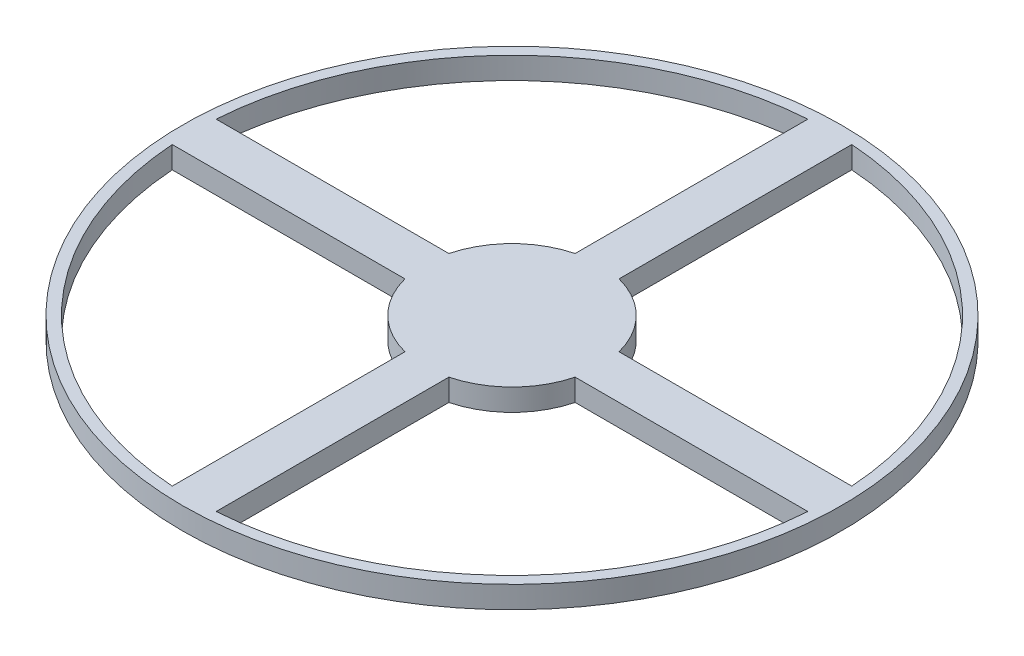
ISO-10303-21;
HEADER;
FILE_DESCRIPTION(('STEP AP214'),'2;1');
FILE_NAME('part.step','',(''),(''),'','','');
FILE_SCHEMA(('AUTOMOTIVE_DESIGN { 1 0 10303 214 1 1 1 1 }'));
ENDSEC;
DATA;
#1=APPLICATION_CONTEXT('core data for automotive mechanical design processes');
#2=APPLICATION_PROTOCOL_DEFINITION('international standard','automotive_design',2000,#1);
#3=PRODUCT_CONTEXT('',#1,'mechanical');
#4=PRODUCT('Part','Part','',(#3));
#5=PRODUCT_RELATED_PRODUCT_CATEGORY('part','',(#4));
#6=PRODUCT_DEFINITION_FORMATION('','',#4);
#7=PRODUCT_DEFINITION_CONTEXT('part definition',#1,'design');
#8=PRODUCT_DEFINITION('design','',#6,#7);
#9=PRODUCT_DEFINITION_SHAPE('','',#8);
#10=(LENGTH_UNIT() NAMED_UNIT(*) SI_UNIT(.MILLI.,.METRE.));
#11=(NAMED_UNIT(*) PLANE_ANGLE_UNIT() SI_UNIT($,.RADIAN.));
#12=(NAMED_UNIT(*) SI_UNIT($,.STERADIAN.) SOLID_ANGLE_UNIT());
#13=UNCERTAINTY_MEASURE_WITH_UNIT(LENGTH_MEASURE(1.E-05),#10,'distance_accuracy_value','');
#14=(GEOMETRIC_REPRESENTATION_CONTEXT(3) GLOBAL_UNCERTAINTY_ASSIGNED_CONTEXT((#13)) GLOBAL_UNIT_ASSIGNED_CONTEXT((#10,
#11,#12)) REPRESENTATION_CONTEXT('',''));
#15=CARTESIAN_POINT('',(0.,0.,0.));
#16=DIRECTION('',(0.,0.,1.));
#17=DIRECTION('',(1.,0.,0.));
#18=AXIS2_PLACEMENT_3D('',#15,#16,#17);
#19=CARTESIAN_POINT('',(0.,6.35,0.));
#20=DIRECTION('',(0.,-1.,0.));
#21=DIRECTION('',(0.,0.,-1.));
#22=AXIS2_PLACEMENT_3D('',#19,#20,#21);
#23=CYLINDRICAL_SURFACE('',#22,25.4);
#24=DIRECTION('',(0.,-1.,0.));
#25=VECTOR('',#24,1.);
#26=CARTESIAN_POINT('',(6.34999999999975,6.35,24.5934442484172));
#27=LINE('',#26,#25);
#28=CARTESIAN_POINT('',(6.34999999999975,6.35,24.5934442484172));
#29=VERTEX_POINT('',#28);
#30=CARTESIAN_POINT('',(6.34999999999975,0.,24.5934442484172));
#31=VERTEX_POINT('',#30);
#32=EDGE_CURVE('E159',#29,#31,#27,.T.);
#33=ORIENTED_EDGE('',*,*,#32,.T.);
#34=CARTESIAN_POINT('',(0.,0.,0.));
#35=DIRECTION('',(0.,1.,0.));
#36=DIRECTION('',(0.,0.,1.));
#37=AXIS2_PLACEMENT_3D('',#34,#35,#36);
#38=CIRCLE('',#37,25.4);
#39=CARTESIAN_POINT('',(24.5934442484171,0.,6.35));
#40=VERTEX_POINT('',#39);
#41=EDGE_CURVE('E205',#31,#40,#38,.T.);
#42=ORIENTED_EDGE('',*,*,#41,.T.);
#43=DIRECTION('',(0.,-1.,0.));
#44=VECTOR('',#43,1.);
#45=CARTESIAN_POINT('',(24.5934442484171,6.35,6.35));
#46=LINE('',#45,#44);
#47=CARTESIAN_POINT('',(24.5934442484171,6.35,6.35));
#48=VERTEX_POINT('',#47);
#49=EDGE_CURVE('E254',#48,#40,#46,.T.);
#50=ORIENTED_EDGE('',*,*,#49,.F.);
#51=CARTESIAN_POINT('',(0.,6.35,0.));
#52=DIRECTION('',(0.,1.,0.));
#53=DIRECTION('',(0.,0.,1.));
#54=AXIS2_PLACEMENT_3D('',#51,#52,#53);
#55=CIRCLE('',#54,25.4);
#56=EDGE_CURVE('E55',#29,#48,#55,.T.);
#57=ORIENTED_EDGE('',*,*,#56,.F.);
#58=EDGE_LOOP('',(#33,#42,#50,#57));
#59=FACE_BOUND('',#58,.T.);
#60=ADVANCED_FACE('F40',(#59),#23,.T.);
#61=DIRECTION('',(0.,-1.,0.));
#62=VECTOR('',#61,1.);
#63=CARTESIAN_POINT('',(-6.35000000000026,6.35,24.593444248417));
#64=LINE('',#63,#62);
#65=CARTESIAN_POINT('',(-6.35000000000026,6.35,24.593444248417));
#66=VERTEX_POINT('',#65);
#67=CARTESIAN_POINT('',(-6.35000000000026,0.,24.593444248417));
#68=VERTEX_POINT('',#67);
#69=EDGE_CURVE('E63',#66,#68,#64,.T.);
#70=ORIENTED_EDGE('',*,*,#69,.F.);
#71=CARTESIAN_POINT('',(-24.5934442484171,6.35,6.35000000000001));
#72=VERTEX_POINT('',#71);
#73=EDGE_CURVE('E199',#72,#66,#55,.T.);
#74=ORIENTED_EDGE('',*,*,#73,.F.);
#75=DIRECTION('',(0.,-1.,0.));
#76=VECTOR('',#75,1.);
#77=CARTESIAN_POINT('',(-24.5934442484171,6.35,6.35000000000001));
#78=LINE('',#77,#76);
#79=CARTESIAN_POINT('',(-24.5934442484171,0.,6.35000000000001));
#80=VERTEX_POINT('',#79);
#81=EDGE_CURVE('E48',#72,#80,#78,.T.);
#82=ORIENTED_EDGE('',*,*,#81,.T.);
#83=EDGE_CURVE('E203',#80,#68,#38,.T.);
#84=ORIENTED_EDGE('',*,*,#83,.T.);
#85=EDGE_LOOP('',(#70,#74,#82,#84));
#86=FACE_BOUND('',#85,.T.);
#87=ADVANCED_FACE('F223',(#86),#23,.T.);
#88=CARTESIAN_POINT('',(0.,6.35,0.));
#89=DIRECTION('',(0.,-1.,0.));
#90=DIRECTION('',(0.,0.,-1.));
#91=AXIS2_PLACEMENT_3D('',#88,#89,#90);
#92=CYLINDRICAL_SURFACE('',#91,92.075);
#93=CARTESIAN_POINT('',(0.,0.,0.));
#94=DIRECTION('',(0.,1.,0.));
#95=DIRECTION('',(0.,0.,1.));
#96=AXIS2_PLACEMENT_3D('',#93,#94,#95);
#97=CIRCLE('',#96,92.075);
#98=CARTESIAN_POINT('',(6.34999999999904,0.,91.855773498458));
#99=VERTEX_POINT('',#98);
#100=CARTESIAN_POINT('',(91.8557734984579,0.,6.35));
#101=VERTEX_POINT('',#100);
#102=EDGE_CURVE('E171',#99,#101,#97,.T.);
#103=ORIENTED_EDGE('',*,*,#102,.F.);
#104=DIRECTION('',(0.,-1.,0.));
#105=VECTOR('',#104,1.);
#106=CARTESIAN_POINT('',(6.34999999999904,6.35,91.855773498458));
#107=LINE('',#106,#105);
#108=CARTESIAN_POINT('',(6.34999999999904,6.35,91.855773498458));
#109=VERTEX_POINT('',#108);
#110=EDGE_CURVE('E157',#109,#99,#107,.T.);
#111=ORIENTED_EDGE('',*,*,#110,.F.);
#112=CARTESIAN_POINT('',(0.,6.35,0.));
#113=DIRECTION('',(0.,1.,0.));
#114=DIRECTION('',(0.,0.,1.));
#115=AXIS2_PLACEMENT_3D('',#112,#113,#114);
#116=CIRCLE('',#115,92.075);
#117=CARTESIAN_POINT('',(91.8557734984579,6.35,6.35));
#118=VERTEX_POINT('',#117);
#119=EDGE_CURVE('E169',#109,#118,#116,.T.);
#120=ORIENTED_EDGE('',*,*,#119,.T.);
#121=DIRECTION('',(0.,-1.,0.));
#122=VECTOR('',#121,1.);
#123=CARTESIAN_POINT('',(91.8557734984579,6.35,6.35));
#124=LINE('',#123,#122);
#125=EDGE_CURVE('E248',#118,#101,#124,.T.);
#126=ORIENTED_EDGE('',*,*,#125,.T.);
#127=EDGE_LOOP('',(#103,#111,#120,#126));
#128=FACE_BOUND('',#127,.T.);
#129=ADVANCED_FACE('F167',(#128),#92,.F.);
#130=CARTESIAN_POINT('',(-91.8557734984579,6.35,6.35));
#131=VERTEX_POINT('',#130);
#132=CARTESIAN_POINT('',(-6.35000000000096,6.35,91.8557734984578));
#133=VERTEX_POINT('',#132);
#134=EDGE_CURVE('E179',#131,#133,#116,.T.);
#135=ORIENTED_EDGE('',*,*,#134,.T.);
#136=DIRECTION('',(0.,-1.,0.));
#137=VECTOR('',#136,1.);
#138=CARTESIAN_POINT('',(-6.35000000000096,6.35,91.8557734984578));
#139=LINE('',#138,#137);
#140=CARTESIAN_POINT('',(-6.35000000000096,0.,91.8557734984578));
#141=VERTEX_POINT('',#140);
#142=EDGE_CURVE('E239',#133,#141,#139,.T.);
#143=ORIENTED_EDGE('',*,*,#142,.T.);
#144=CARTESIAN_POINT('',(-91.8557734984579,0.,6.35));
#145=VERTEX_POINT('',#144);
#146=EDGE_CURVE('E189',#145,#141,#97,.T.);
#147=ORIENTED_EDGE('',*,*,#146,.F.);
#148=DIRECTION('',(0.,-1.,0.));
#149=VECTOR('',#148,1.);
#150=CARTESIAN_POINT('',(-91.8557734984579,6.35,6.35));
#151=LINE('',#150,#149);
#152=EDGE_CURVE('E12',#131,#145,#151,.T.);
#153=ORIENTED_EDGE('',*,*,#152,.F.);
#154=EDGE_LOOP('',(#135,#143,#147,#153));
#155=FACE_BOUND('',#154,.T.);
#156=ADVANCED_FACE('F348',(#155),#92,.F.);
#157=DIRECTION('',(0.,-1.,0.));
#158=VECTOR('',#157,1.);
#159=CARTESIAN_POINT('',(24.5934442484171,6.35,-6.35000000000001));
#160=LINE('',#159,#158);
#161=CARTESIAN_POINT('',(24.5934442484171,6.35,-6.35000000000001));
#162=VERTEX_POINT('',#161);
#163=CARTESIAN_POINT('',(24.5934442484171,0.,-6.35000000000001));
#164=VERTEX_POINT('',#163);
#165=EDGE_CURVE('E257',#162,#164,#160,.T.);
#166=ORIENTED_EDGE('',*,*,#165,.T.);
#167=CARTESIAN_POINT('',(6.35000000000009,0.,-24.5934442484171));
#168=VERTEX_POINT('',#167);
#169=EDGE_CURVE('E297',#164,#168,#38,.T.);
#170=ORIENTED_EDGE('',*,*,#169,.T.);
#171=DIRECTION('',(0.,-1.,0.));
#172=VECTOR('',#171,1.);
#173=CARTESIAN_POINT('',(6.35000000000008,6.35,-24.5934442484171));
#174=LINE('',#173,#172);
#175=CARTESIAN_POINT('',(6.35000000000008,6.35,-24.5934442484171));
#176=VERTEX_POINT('',#175);
#177=EDGE_CURVE('E277',#176,#168,#174,.T.);
#178=ORIENTED_EDGE('',*,*,#177,.F.);
#179=EDGE_CURVE('E310',#162,#176,#55,.T.);
#180=ORIENTED_EDGE('',*,*,#179,.F.);
#181=EDGE_LOOP('',(#166,#170,#178,#180));
#182=FACE_BOUND('',#181,.T.);
#183=ADVANCED_FACE('F316',(#182),#23,.T.);
#184=CARTESIAN_POINT('',(91.8557734984579,0.,-6.35));
#185=VERTEX_POINT('',#184);
#186=CARTESIAN_POINT('',(6.35000000000032,0.,-91.8557734984579));
#187=VERTEX_POINT('',#186);
#188=EDGE_CURVE('E286',#185,#187,#97,.T.);
#189=ORIENTED_EDGE('',*,*,#188,.F.);
#190=DIRECTION('',(0.,-1.,0.));
#191=VECTOR('',#190,1.);
#192=CARTESIAN_POINT('',(91.8557734984579,6.35,-6.35));
#193=LINE('',#192,#191);
#194=CARTESIAN_POINT('',(91.8557734984579,6.35,-6.35));
#195=VERTEX_POINT('',#194);
#196=EDGE_CURVE('E260',#195,#185,#193,.T.);
#197=ORIENTED_EDGE('',*,*,#196,.F.);
#198=CARTESIAN_POINT('',(6.35000000000032,6.35,-91.8557734984579));
#199=VERTEX_POINT('',#198);
#200=EDGE_CURVE('E180',#195,#199,#116,.T.);
#201=ORIENTED_EDGE('',*,*,#200,.T.);
#202=DIRECTION('',(0.,-1.,0.));
#203=VECTOR('',#202,1.);
#204=CARTESIAN_POINT('',(6.35000000000032,6.35,-91.8557734984579));
#205=LINE('',#204,#203);
#206=EDGE_CURVE('E270',#199,#187,#205,.T.);
#207=ORIENTED_EDGE('',*,*,#206,.T.);
#208=EDGE_LOOP('',(#189,#197,#201,#207));
#209=FACE_BOUND('',#208,.T.);
#210=ADVANCED_FACE('F320',(#209),#92,.F.);
#211=DIRECTION('',(0.,-1.,0.));
#212=VECTOR('',#211,1.);
#213=CARTESIAN_POINT('',(-6.34999999999992,6.35,-24.5934442484171));
#214=LINE('',#213,#212);
#215=CARTESIAN_POINT('',(-6.34999999999991,6.35,-24.5934442484171));
#216=VERTEX_POINT('',#215);
#217=CARTESIAN_POINT('',(-6.34999999999992,0.,-24.5934442484171));
#218=VERTEX_POINT('',#217);
#219=EDGE_CURVE('E279',#216,#218,#214,.T.);
#220=ORIENTED_EDGE('',*,*,#219,.T.);
#221=CARTESIAN_POINT('',(-24.5934442484171,0.,-6.35));
#222=VERTEX_POINT('',#221);
#223=EDGE_CURVE('E195',#218,#222,#38,.T.);
#224=ORIENTED_EDGE('',*,*,#223,.T.);
#225=DIRECTION('',(0.,-1.,0.));
#226=VECTOR('',#225,1.);
#227=CARTESIAN_POINT('',(-24.5934442484171,6.35,-6.35));
#228=LINE('',#227,#226);
#229=CARTESIAN_POINT('',(-24.5934442484171,6.35,-6.35));
#230=VERTEX_POINT('',#229);
#231=EDGE_CURVE('E218',#230,#222,#228,.T.);
#232=ORIENTED_EDGE('',*,*,#231,.F.);
#233=EDGE_CURVE('E202',#216,#230,#55,.T.);
#234=ORIENTED_EDGE('',*,*,#233,.F.);
#235=EDGE_LOOP('',(#220,#224,#232,#234));
#236=FACE_BOUND('',#235,.T.);
#237=ADVANCED_FACE('F301',(#236),#23,.T.);
#238=CARTESIAN_POINT('',(-6.34999999999968,0.,-91.8557734984579));
#239=VERTEX_POINT('',#238);
#240=CARTESIAN_POINT('',(-91.8557734984579,0.,-6.35));
#241=VERTEX_POINT('',#240);
#242=EDGE_CURVE('E192',#239,#241,#97,.T.);
#243=ORIENTED_EDGE('',*,*,#242,.F.);
#244=DIRECTION('',(0.,-1.,0.));
#245=VECTOR('',#244,1.);
#246=CARTESIAN_POINT('',(-6.34999999999968,6.35,-91.8557734984579));
#247=LINE('',#246,#245);
#248=CARTESIAN_POINT('',(-6.34999999999968,6.35,-91.8557734984579));
#249=VERTEX_POINT('',#248);
#250=EDGE_CURVE('E187',#249,#239,#247,.T.);
#251=ORIENTED_EDGE('',*,*,#250,.F.);
#252=CARTESIAN_POINT('',(-91.8557734984579,6.35,-6.35));
#253=VERTEX_POINT('',#252);
#254=EDGE_CURVE('E184',#249,#253,#116,.T.);
#255=ORIENTED_EDGE('',*,*,#254,.T.);
#256=DIRECTION('',(0.,-1.,0.));
#257=VECTOR('',#256,1.);
#258=CARTESIAN_POINT('',(-91.8557734984579,6.35,-6.35));
#259=LINE('',#258,#257);
#260=EDGE_CURVE('E212',#253,#241,#259,.T.);
#261=ORIENTED_EDGE('',*,*,#260,.T.);
#262=EDGE_LOOP('',(#243,#251,#255,#261));
#263=FACE_BOUND('',#262,.T.);
#264=ADVANCED_FACE('F341',(#263),#92,.F.);
#265=CARTESIAN_POINT('',(-91.8557734984579,6.35,6.35));
#266=DIRECTION('',(0.,0.,-1.));
#267=DIRECTION('',(-1.,0.,0.));
#268=AXIS2_PLACEMENT_3D('',#265,#266,#267);
#269=PLANE('',#268);
#270=DIRECTION('',(1.,0.,0.));
#271=VECTOR('',#270,1.);
#272=CARTESIAN_POINT('',(-91.8557734984579,0.,6.35));
#273=LINE('',#272,#271);
#274=EDGE_CURVE('E201',#145,#80,#273,.T.);
#275=ORIENTED_EDGE('',*,*,#274,.T.);
#276=ORIENTED_EDGE('',*,*,#81,.F.);
#277=DIRECTION('',(1.,0.,0.));
#278=VECTOR('',#277,1.);
#279=CARTESIAN_POINT('',(-91.8557734984579,6.35,6.35));
#280=LINE('',#279,#278);
#281=EDGE_CURVE('E206',#131,#72,#280,.T.);
#282=ORIENTED_EDGE('',*,*,#281,.F.);
#283=ORIENTED_EDGE('',*,*,#152,.T.);
#284=EDGE_LOOP('',(#275,#276,#282,#283));
#285=FACE_BOUND('',#284,.T.);
#286=ADVANCED_FACE('F42',(#285),#269,.F.);
#287=CARTESIAN_POINT('',(-91.8557734984579,6.35,-6.35));
#288=DIRECTION('',(0.,0.,1.));
#289=DIRECTION('',(1.,0.,0.));
#290=AXIS2_PLACEMENT_3D('',#287,#288,#289);
#291=PLANE('',#290);
#292=DIRECTION('',(-1.,0.,0.));
#293=VECTOR('',#292,1.);
#294=CARTESIAN_POINT('',(-91.8557734984579,0.,-6.35));
#295=LINE('',#294,#293);
#296=EDGE_CURVE('E209',#222,#241,#295,.T.);
#297=ORIENTED_EDGE('',*,*,#296,.T.);
#298=ORIENTED_EDGE('',*,*,#260,.F.);
#299=DIRECTION('',(-1.,0.,0.));
#300=VECTOR('',#299,1.);
#301=CARTESIAN_POINT('',(-91.8557734984579,6.35,-6.35));
#302=LINE('',#301,#300);
#303=EDGE_CURVE('E208',#230,#253,#302,.T.);
#304=ORIENTED_EDGE('',*,*,#303,.F.);
#305=ORIENTED_EDGE('',*,*,#231,.T.);
#306=EDGE_LOOP('',(#297,#298,#304,#305));
#307=FACE_BOUND('',#306,.T.);
#308=ADVANCED_FACE('F306',(#307),#291,.F.);
#309=CARTESIAN_POINT('',(0.,6.35,0.));
#310=DIRECTION('',(0.,1.,0.));
#311=DIRECTION('',(0.,0.,1.));
#312=AXIS2_PLACEMENT_3D('',#309,#310,#311);
#313=PLANE('',#312);
#314=ORIENTED_EDGE('',*,*,#119,.F.);
#315=DIRECTION('',(0.,0.,-1.));
#316=VECTOR('',#315,1.);
#317=CARTESIAN_POINT('',(6.34999999999904,6.35,91.855773498458));
#318=LINE('',#317,#316);
#319=EDGE_CURVE('E153',#109,#29,#318,.T.);
#320=ORIENTED_EDGE('',*,*,#319,.T.);
#321=ORIENTED_EDGE('',*,*,#56,.T.);
#322=DIRECTION('',(1.,0.,0.));
#323=VECTOR('',#322,1.);
#324=CARTESIAN_POINT('',(91.8557734984579,6.35,6.35));
#325=LINE('',#324,#323);
#326=EDGE_CURVE('E177',#48,#118,#325,.T.);
#327=ORIENTED_EDGE('',*,*,#326,.T.);
#328=EDGE_LOOP('',(#314,#320,#321,#327));
#329=FACE_BOUND('',#328,.T.);
#330=ORIENTED_EDGE('',*,*,#200,.F.);
#331=DIRECTION('',(-1.,0.,0.));
#332=VECTOR('',#331,1.);
#333=CARTESIAN_POINT('',(91.8557734984579,6.35,-6.35));
#334=LINE('',#333,#332);
#335=EDGE_CURVE('E243',#195,#162,#334,.T.);
#336=ORIENTED_EDGE('',*,*,#335,.T.);
#337=ORIENTED_EDGE('',*,*,#179,.T.);
#338=DIRECTION('',(0.,0.,-1.));
#339=VECTOR('',#338,1.);
#340=CARTESIAN_POINT('',(6.35000000000032,6.35,-91.8557734984579));
#341=LINE('',#340,#339);
#342=EDGE_CURVE('E266',#176,#199,#341,.T.);
#343=ORIENTED_EDGE('',*,*,#342,.T.);
#344=EDGE_LOOP('',(#330,#336,#337,#343));
#345=FACE_BOUND('',#344,.T.);
#346=ORIENTED_EDGE('',*,*,#73,.T.);
#347=DIRECTION('',(0.,0.,1.));
#348=VECTOR('',#347,1.);
#349=CARTESIAN_POINT('',(-6.35000000000096,6.35,91.8557734984578));
#350=LINE('',#349,#348);
#351=EDGE_CURVE('E162',#66,#133,#350,.T.);
#352=ORIENTED_EDGE('',*,*,#351,.T.);
#353=ORIENTED_EDGE('',*,*,#134,.F.);
#354=ORIENTED_EDGE('',*,*,#281,.T.);
#355=EDGE_LOOP('',(#346,#352,#353,#354));
#356=FACE_BOUND('',#355,.T.);
#357=ORIENTED_EDGE('',*,*,#303,.T.);
#358=ORIENTED_EDGE('',*,*,#254,.F.);
#359=DIRECTION('',(0.,0.,1.));
#360=VECTOR('',#359,1.);
#361=CARTESIAN_POINT('',(-6.34999999999968,6.35,-91.8557734984579));
#362=LINE('',#361,#360);
#363=EDGE_CURVE('E263',#249,#216,#362,.T.);
#364=ORIENTED_EDGE('',*,*,#363,.T.);
#365=ORIENTED_EDGE('',*,*,#233,.T.);
#366=EDGE_LOOP('',(#357,#358,#364,#365));
#367=FACE_BOUND('',#366,.T.);
#368=CARTESIAN_POINT('',(0.,6.35,0.));
#369=DIRECTION('',(0.,1.,0.));
#370=DIRECTION('',(0.,0.,1.));
#371=AXIS2_PLACEMENT_3D('',#368,#369,#370);
#372=CIRCLE('',#371,95.25);
#373=CARTESIAN_POINT('',(0.,6.35,95.25));
#374=VERTEX_POINT('',#373);
#375=EDGE_CURVE('E193',#374,#374,#372,.T.);
#376=ORIENTED_EDGE('',*,*,#375,.T.);
#377=EDGE_LOOP('',(#376));
#378=FACE_BOUND('',#377,.T.);
#379=ADVANCED_FACE('F174',(#329,#345,#356,#367,#378),#313,.T.);
#380=CARTESIAN_POINT('',(0.,0.,0.));
#381=DIRECTION('',(0.,1.,0.));
#382=DIRECTION('',(0.,0.,1.));
#383=AXIS2_PLACEMENT_3D('',#380,#381,#382);
#384=PLANE('',#383);
#385=DIRECTION('',(0.,0.,-1.));
#386=VECTOR('',#385,1.);
#387=CARTESIAN_POINT('',(6.34999999999904,0.,91.855773498458));
#388=LINE('',#387,#386);
#389=EDGE_CURVE('E234',#99,#31,#388,.T.);
#390=ORIENTED_EDGE('',*,*,#389,.F.);
#391=ORIENTED_EDGE('',*,*,#102,.T.);
#392=DIRECTION('',(1.,0.,0.));
#393=VECTOR('',#392,1.);
#394=CARTESIAN_POINT('',(91.8557734984579,0.,6.35));
#395=LINE('',#394,#393);
#396=EDGE_CURVE('E246',#40,#101,#395,.T.);
#397=ORIENTED_EDGE('',*,*,#396,.F.);
#398=ORIENTED_EDGE('',*,*,#41,.F.);
#399=EDGE_LOOP('',(#390,#391,#397,#398));
#400=FACE_BOUND('',#399,.T.);
#401=DIRECTION('',(-1.,0.,0.));
#402=VECTOR('',#401,1.);
#403=CARTESIAN_POINT('',(91.8557734984579,0.,-6.35));
#404=LINE('',#403,#402);
#405=EDGE_CURVE('E172',#185,#164,#404,.T.);
#406=ORIENTED_EDGE('',*,*,#405,.F.);
#407=ORIENTED_EDGE('',*,*,#188,.T.);
#408=DIRECTION('',(0.,0.,-1.));
#409=VECTOR('',#408,1.);
#410=CARTESIAN_POINT('',(6.35000000000032,0.,-91.8557734984579));
#411=LINE('',#410,#409);
#412=EDGE_CURVE('E267',#168,#187,#411,.T.);
#413=ORIENTED_EDGE('',*,*,#412,.F.);
#414=ORIENTED_EDGE('',*,*,#169,.F.);
#415=EDGE_LOOP('',(#406,#407,#413,#414));
#416=FACE_BOUND('',#415,.T.);
#417=ORIENTED_EDGE('',*,*,#146,.T.);
#418=DIRECTION('',(0.,0.,1.));
#419=VECTOR('',#418,1.);
#420=CARTESIAN_POINT('',(-6.35000000000096,0.,91.8557734984578));
#421=LINE('',#420,#419);
#422=EDGE_CURVE('E163',#68,#141,#421,.T.);
#423=ORIENTED_EDGE('',*,*,#422,.F.);
#424=ORIENTED_EDGE('',*,*,#83,.F.);
#425=ORIENTED_EDGE('',*,*,#274,.F.);
#426=EDGE_LOOP('',(#417,#423,#424,#425));
#427=FACE_BOUND('',#426,.T.);
#428=ORIENTED_EDGE('',*,*,#223,.F.);
#429=DIRECTION('',(0.,0.,1.));
#430=VECTOR('',#429,1.);
#431=CARTESIAN_POINT('',(-6.34999999999968,0.,-91.8557734984579));
#432=LINE('',#431,#430);
#433=EDGE_CURVE('E262',#239,#218,#432,.T.);
#434=ORIENTED_EDGE('',*,*,#433,.F.);
#435=ORIENTED_EDGE('',*,*,#242,.T.);
#436=ORIENTED_EDGE('',*,*,#296,.F.);
#437=EDGE_LOOP('',(#428,#434,#435,#436));
#438=FACE_BOUND('',#437,.T.);
#439=CARTESIAN_POINT('',(0.,0.,0.));
#440=DIRECTION('',(0.,1.,0.));
#441=DIRECTION('',(0.,0.,1.));
#442=AXIS2_PLACEMENT_3D('',#439,#440,#441);
#443=CIRCLE('',#442,95.25);
#444=CARTESIAN_POINT('',(0.,0.,95.25));
#445=VERTEX_POINT('',#444);
#446=EDGE_CURVE('E183',#445,#445,#443,.T.);
#447=ORIENTED_EDGE('',*,*,#446,.F.);
#448=EDGE_LOOP('',(#447));
#449=FACE_BOUND('',#448,.T.);
#450=ADVANCED_FACE('F228',(#400,#416,#427,#438,#449),#384,.F.);
#451=CARTESIAN_POINT('',(0.,6.35,0.));
#452=DIRECTION('',(0.,-1.,0.));
#453=DIRECTION('',(0.,0.,-1.));
#454=AXIS2_PLACEMENT_3D('',#451,#452,#453);
#455=CYLINDRICAL_SURFACE('',#454,95.25);
#456=ORIENTED_EDGE('',*,*,#375,.F.);
#457=EDGE_LOOP('',(#456));
#458=FACE_BOUND('',#457,.T.);
#459=ORIENTED_EDGE('',*,*,#446,.T.);
#460=EDGE_LOOP('',(#459));
#461=FACE_BOUND('',#460,.T.);
#462=ADVANCED_FACE('F325',(#458,#461),#455,.T.);
#463=CARTESIAN_POINT('',(-6.34999999999968,6.35,-91.8557734984579));
#464=DIRECTION('',(1.,0.,0.));
#465=DIRECTION('',(0.,0.,-1.));
#466=AXIS2_PLACEMENT_3D('',#463,#464,#465);
#467=PLANE('',#466);
#468=ORIENTED_EDGE('',*,*,#433,.T.);
#469=ORIENTED_EDGE('',*,*,#219,.F.);
#470=ORIENTED_EDGE('',*,*,#363,.F.);
#471=ORIENTED_EDGE('',*,*,#250,.T.);
#472=EDGE_LOOP('',(#468,#469,#470,#471));
#473=FACE_BOUND('',#472,.T.);
#474=ADVANCED_FACE('F331',(#473),#467,.F.);
#475=CARTESIAN_POINT('',(6.35000000000032,6.35,-91.8557734984579));
#476=DIRECTION('',(-1.,0.,0.));
#477=DIRECTION('',(0.,0.,1.));
#478=AXIS2_PLACEMENT_3D('',#475,#476,#477);
#479=PLANE('',#478);
#480=ORIENTED_EDGE('',*,*,#412,.T.);
#481=ORIENTED_EDGE('',*,*,#206,.F.);
#482=ORIENTED_EDGE('',*,*,#342,.F.);
#483=ORIENTED_EDGE('',*,*,#177,.T.);
#484=EDGE_LOOP('',(#480,#481,#482,#483));
#485=FACE_BOUND('',#484,.T.);
#486=ADVANCED_FACE('F318',(#485),#479,.F.);
#487=CARTESIAN_POINT('',(91.8557734984579,6.35,-6.35));
#488=DIRECTION('',(0.,0.,1.));
#489=DIRECTION('',(1.,0.,0.));
#490=AXIS2_PLACEMENT_3D('',#487,#488,#489);
#491=PLANE('',#490);
#492=ORIENTED_EDGE('',*,*,#405,.T.);
#493=ORIENTED_EDGE('',*,*,#165,.F.);
#494=ORIENTED_EDGE('',*,*,#335,.F.);
#495=ORIENTED_EDGE('',*,*,#196,.T.);
#496=EDGE_LOOP('',(#492,#493,#494,#495));
#497=FACE_BOUND('',#496,.T.);
#498=ADVANCED_FACE('F323',(#497),#491,.F.);
#499=CARTESIAN_POINT('',(91.8557734984579,6.35,6.35));
#500=DIRECTION('',(0.,0.,-1.));
#501=DIRECTION('',(-1.,0.,0.));
#502=AXIS2_PLACEMENT_3D('',#499,#500,#501);
#503=PLANE('',#502);
#504=ORIENTED_EDGE('',*,*,#396,.T.);
#505=ORIENTED_EDGE('',*,*,#125,.F.);
#506=ORIENTED_EDGE('',*,*,#326,.F.);
#507=ORIENTED_EDGE('',*,*,#49,.T.);
#508=EDGE_LOOP('',(#504,#505,#506,#507));
#509=FACE_BOUND('',#508,.T.);
#510=ADVANCED_FACE('F296',(#509),#503,.F.);
#511=CARTESIAN_POINT('',(6.34999999999904,6.35,91.855773498458));
#512=DIRECTION('',(-1.,0.,0.));
#513=DIRECTION('',(0.,0.,1.));
#514=AXIS2_PLACEMENT_3D('',#511,#512,#513);
#515=PLANE('',#514);
#516=ORIENTED_EDGE('',*,*,#389,.T.);
#517=ORIENTED_EDGE('',*,*,#32,.F.);
#518=ORIENTED_EDGE('',*,*,#319,.F.);
#519=ORIENTED_EDGE('',*,*,#110,.T.);
#520=EDGE_LOOP('',(#516,#517,#518,#519));
#521=FACE_BOUND('',#520,.T.);
#522=ADVANCED_FACE('F156',(#521),#515,.F.);
#523=CARTESIAN_POINT('',(-6.35000000000096,6.35,91.8557734984578));
#524=DIRECTION('',(1.,0.,0.));
#525=DIRECTION('',(0.,0.,-1.));
#526=AXIS2_PLACEMENT_3D('',#523,#524,#525);
#527=PLANE('',#526);
#528=ORIENTED_EDGE('',*,*,#422,.T.);
#529=ORIENTED_EDGE('',*,*,#142,.F.);
#530=ORIENTED_EDGE('',*,*,#351,.F.);
#531=ORIENTED_EDGE('',*,*,#69,.T.);
#532=EDGE_LOOP('',(#528,#529,#530,#531));
#533=FACE_BOUND('',#532,.T.);
#534=ADVANCED_FACE('F368',(#533),#527,.F.);
#535=CLOSED_SHELL('',(#60,#87,#129,#156,#183,#210,#237,#264,#286,#308,#379,#450,#462,#474,#486,
#498,#510,#522,#534));
#536=MANIFOLD_SOLID_BREP('B2',#535);
#537=ADVANCED_BREP_SHAPE_REPRESENTATION('',(#18,#536),#14);
#538=SHAPE_DEFINITION_REPRESENTATION(#9,#537);
ENDSEC;
END-ISO-10303-21;
